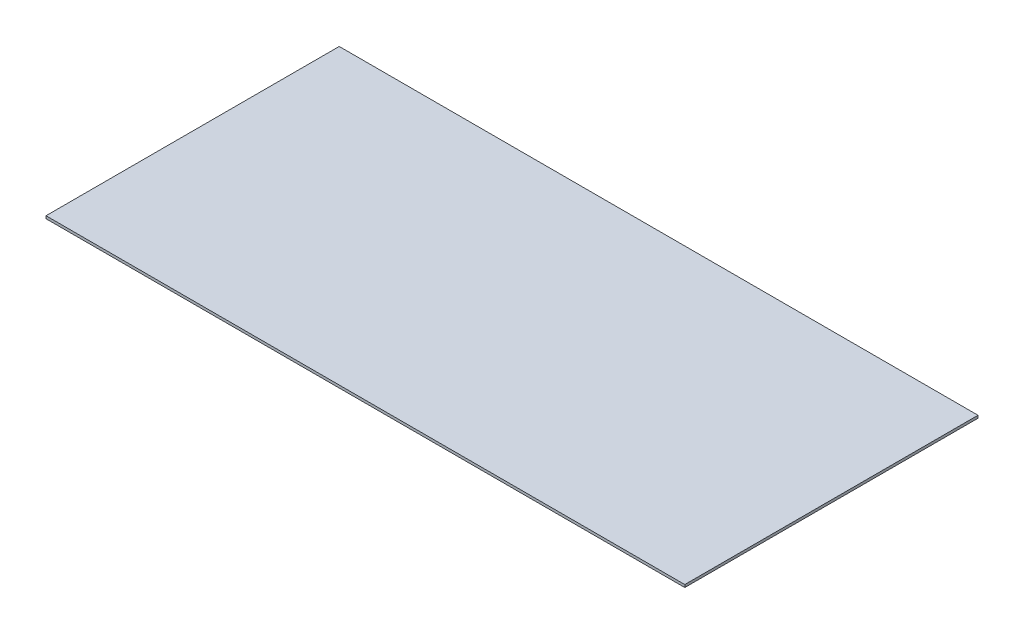
ISO-10303-21;
HEADER;
FILE_DESCRIPTION(('STEP AP214'),'2;1');
FILE_NAME('part.step','',(''),(''),'','','');
FILE_SCHEMA(('AUTOMOTIVE_DESIGN { 1 0 10303 214 1 1 1 1 }'));
ENDSEC;
DATA;
#1=APPLICATION_CONTEXT('core data for automotive mechanical design processes');
#2=APPLICATION_PROTOCOL_DEFINITION('international standard','automotive_design',2000,#1);
#3=PRODUCT_CONTEXT('',#1,'mechanical');
#4=PRODUCT('Part','Part','',(#3));
#5=PRODUCT_RELATED_PRODUCT_CATEGORY('part','',(#4));
#6=PRODUCT_DEFINITION_FORMATION('','',#4);
#7=PRODUCT_DEFINITION_CONTEXT('part definition',#1,'design');
#8=PRODUCT_DEFINITION('design','',#6,#7);
#9=PRODUCT_DEFINITION_SHAPE('','',#8);
#10=(LENGTH_UNIT() NAMED_UNIT(*) SI_UNIT(.MILLI.,.METRE.));
#11=(NAMED_UNIT(*) PLANE_ANGLE_UNIT() SI_UNIT($,.RADIAN.));
#12=(NAMED_UNIT(*) SI_UNIT($,.STERADIAN.) SOLID_ANGLE_UNIT());
#13=UNCERTAINTY_MEASURE_WITH_UNIT(LENGTH_MEASURE(1.E-05),#10,'distance_accuracy_value','');
#14=(GEOMETRIC_REPRESENTATION_CONTEXT(3) GLOBAL_UNCERTAINTY_ASSIGNED_CONTEXT((#13)) GLOBAL_UNIT_ASSIGNED_CONTEXT((#10,
#11,#12)) REPRESENTATION_CONTEXT('',''));
#15=CARTESIAN_POINT('',(0.,0.,0.));
#16=DIRECTION('',(0.,0.,1.));
#17=DIRECTION('',(1.,0.,0.));
#18=AXIS2_PLACEMENT_3D('',#15,#16,#17);
#19=CARTESIAN_POINT('',(0.,1.5875,0.));
#20=DIRECTION('',(0.,1.,0.));
#21=DIRECTION('',(0.,0.,1.));
#22=AXIS2_PLACEMENT_3D('',#19,#20,#21);
#23=PLANE('',#22);
#24=DIRECTION('',(-1.,0.,0.));
#25=VECTOR('',#24,1.);
#26=CARTESIAN_POINT('',(387.35,1.5875,-177.8));
#27=LINE('',#26,#25);
#28=CARTESIAN_POINT('',(-387.35,1.5875,-177.8));
#29=VERTEX_POINT('',#28);
#30=CARTESIAN_POINT('',(387.35,1.5875,-177.8));
#31=VERTEX_POINT('',#30);
#32=EDGE_CURVE('E67',#29,#31,#27,.F.);
#33=ORIENTED_EDGE('',*,*,#32,.F.);
#34=DIRECTION('',(0.,0.,1.));
#35=VECTOR('',#34,1.);
#36=CARTESIAN_POINT('',(-387.35,1.5875,-177.8));
#37=LINE('',#36,#35);
#38=CARTESIAN_POINT('',(-387.35,1.5875,177.8));
#39=VERTEX_POINT('',#38);
#40=EDGE_CURVE('E19',#39,#29,#37,.F.);
#41=ORIENTED_EDGE('',*,*,#40,.F.);
#42=DIRECTION('',(1.,0.,0.));
#43=VECTOR('',#42,1.);
#44=CARTESIAN_POINT('',(-387.35,1.5875,177.8));
#45=LINE('',#44,#43);
#46=CARTESIAN_POINT('',(387.35,1.5875,177.8));
#47=VERTEX_POINT('',#46);
#48=EDGE_CURVE('E57',#47,#39,#45,.F.);
#49=ORIENTED_EDGE('',*,*,#48,.F.);
#50=DIRECTION('',(0.,0.,-1.));
#51=VECTOR('',#50,1.);
#52=CARTESIAN_POINT('',(387.35,1.5875,177.8));
#53=LINE('',#52,#51);
#54=EDGE_CURVE('E52',#31,#47,#53,.F.);
#55=ORIENTED_EDGE('',*,*,#54,.F.);
#56=EDGE_LOOP('',(#33,#41,#49,#55));
#57=FACE_BOUND('',#56,.T.);
#58=ADVANCED_FACE('F16',(#57),#23,.T.);
#59=CARTESIAN_POINT('',(-387.35,-1.5875,-177.8));
#60=DIRECTION('',(-1.,0.,0.));
#61=DIRECTION('',(0.,0.,1.));
#62=AXIS2_PLACEMENT_3D('',#59,#60,#61);
#63=PLANE('',#62);
#64=DIRECTION('',(0.,1.,0.));
#65=VECTOR('',#64,1.);
#66=CARTESIAN_POINT('',(-387.35,-1.5875,-177.8));
#67=LINE('',#66,#65);
#68=CARTESIAN_POINT('',(-387.35,-1.5875,-177.8));
#69=VERTEX_POINT('',#68);
#70=EDGE_CURVE('E78',#69,#29,#67,.T.);
#71=ORIENTED_EDGE('',*,*,#70,.F.);
#72=DIRECTION('',(0.,0.,1.));
#73=VECTOR('',#72,1.);
#74=CARTESIAN_POINT('',(-387.35,-1.5875,0.));
#75=LINE('',#74,#73);
#76=CARTESIAN_POINT('',(-387.35,-1.5875,177.8));
#77=VERTEX_POINT('',#76);
#78=EDGE_CURVE('E73',#69,#77,#75,.T.);
#79=ORIENTED_EDGE('',*,*,#78,.T.);
#80=DIRECTION('',(0.,1.,0.));
#81=VECTOR('',#80,1.);
#82=CARTESIAN_POINT('',(-387.35,-1.5875,177.8));
#83=LINE('',#82,#81);
#84=EDGE_CURVE('E62',#39,#77,#83,.F.);
#85=ORIENTED_EDGE('',*,*,#84,.F.);
#86=ORIENTED_EDGE('',*,*,#40,.T.);
#87=EDGE_LOOP('',(#71,#79,#85,#86));
#88=FACE_BOUND('',#87,.T.);
#89=ADVANCED_FACE('F72',(#88),#63,.T.);
#90=CARTESIAN_POINT('',(-387.35,-1.5875,177.8));
#91=DIRECTION('',(0.,0.,1.));
#92=DIRECTION('',(1.,0.,0.));
#93=AXIS2_PLACEMENT_3D('',#90,#91,#92);
#94=PLANE('',#93);
#95=ORIENTED_EDGE('',*,*,#84,.T.);
#96=DIRECTION('',(1.,0.,0.));
#97=VECTOR('',#96,1.);
#98=CARTESIAN_POINT('',(0.,-1.5875,177.8));
#99=LINE('',#98,#97);
#100=CARTESIAN_POINT('',(387.35,-1.5875,177.8));
#101=VERTEX_POINT('',#100);
#102=EDGE_CURVE('E83',#77,#101,#99,.T.);
#103=ORIENTED_EDGE('',*,*,#102,.T.);
#104=DIRECTION('',(0.,1.,0.));
#105=VECTOR('',#104,1.);
#106=CARTESIAN_POINT('',(387.35,-1.5875,177.8));
#107=LINE('',#106,#105);
#108=EDGE_CURVE('E64',#47,#101,#107,.F.);
#109=ORIENTED_EDGE('',*,*,#108,.F.);
#110=ORIENTED_EDGE('',*,*,#48,.T.);
#111=EDGE_LOOP('',(#95,#103,#109,#110));
#112=FACE_BOUND('',#111,.T.);
#113=ADVANCED_FACE('F59',(#112),#94,.T.);
#114=CARTESIAN_POINT('',(387.35,-1.5875,177.8));
#115=DIRECTION('',(1.,0.,0.));
#116=DIRECTION('',(0.,0.,-1.));
#117=AXIS2_PLACEMENT_3D('',#114,#115,#116);
#118=PLANE('',#117);
#119=ORIENTED_EDGE('',*,*,#108,.T.);
#120=DIRECTION('',(0.,0.,1.));
#121=VECTOR('',#120,1.);
#122=CARTESIAN_POINT('',(387.35,-1.5875,0.));
#123=LINE('',#122,#121);
#124=CARTESIAN_POINT('',(387.35,-1.5875,-177.8));
#125=VERTEX_POINT('',#124);
#126=EDGE_CURVE('E25',#101,#125,#123,.F.);
#127=ORIENTED_EDGE('',*,*,#126,.T.);
#128=DIRECTION('',(0.,1.,0.));
#129=VECTOR('',#128,1.);
#130=CARTESIAN_POINT('',(387.35,-1.5875,-177.8));
#131=LINE('',#130,#129);
#132=EDGE_CURVE('E33',#31,#125,#131,.F.);
#133=ORIENTED_EDGE('',*,*,#132,.F.);
#134=ORIENTED_EDGE('',*,*,#54,.T.);
#135=EDGE_LOOP('',(#119,#127,#133,#134));
#136=FACE_BOUND('',#135,.T.);
#137=ADVANCED_FACE('F87',(#136),#118,.T.);
#138=CARTESIAN_POINT('',(387.35,-1.5875,-177.8));
#139=DIRECTION('',(0.,0.,-1.));
#140=DIRECTION('',(-1.,0.,0.));
#141=AXIS2_PLACEMENT_3D('',#138,#139,#140);
#142=PLANE('',#141);
#143=ORIENTED_EDGE('',*,*,#132,.T.);
#144=DIRECTION('',(1.,0.,0.));
#145=VECTOR('',#144,1.);
#146=CARTESIAN_POINT('',(0.,-1.5875,-177.8));
#147=LINE('',#146,#145);
#148=EDGE_CURVE('E11',#125,#69,#147,.F.);
#149=ORIENTED_EDGE('',*,*,#148,.T.);
#150=ORIENTED_EDGE('',*,*,#70,.T.);
#151=ORIENTED_EDGE('',*,*,#32,.T.);
#152=EDGE_LOOP('',(#143,#149,#150,#151));
#153=FACE_BOUND('',#152,.T.);
#154=ADVANCED_FACE('F90',(#153),#142,.T.);
#155=CARTESIAN_POINT('',(0.,-1.5875,0.));
#156=DIRECTION('',(0.,1.,0.));
#157=DIRECTION('',(0.,0.,1.));
#158=AXIS2_PLACEMENT_3D('',#155,#156,#157);
#159=PLANE('',#158);
#160=ORIENTED_EDGE('',*,*,#126,.F.);
#161=ORIENTED_EDGE('',*,*,#102,.F.);
#162=ORIENTED_EDGE('',*,*,#78,.F.);
#163=ORIENTED_EDGE('',*,*,#148,.F.);
#164=EDGE_LOOP('',(#160,#161,#162,#163));
#165=FACE_BOUND('',#164,.T.);
#166=ADVANCED_FACE('F89',(#165),#159,.F.);
#167=CLOSED_SHELL('',(#58,#89,#113,#137,#154,#166));
#168=MANIFOLD_SOLID_BREP('B1',#167);
#169=ADVANCED_BREP_SHAPE_REPRESENTATION('',(#18,#168),#14);
#170=SHAPE_DEFINITION_REPRESENTATION(#9,#169);
ENDSEC;
END-ISO-10303-21;
